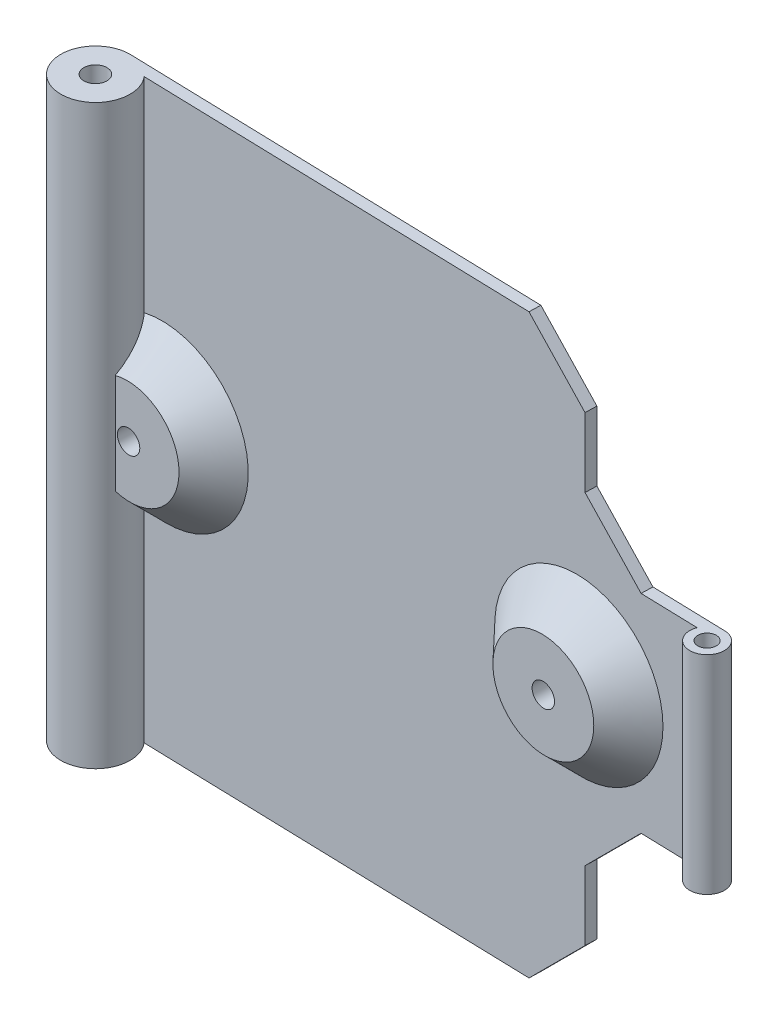
ISO-10303-21;
HEADER;
FILE_DESCRIPTION(('STEP AP214'),'2;1');
FILE_NAME('part.step','',(''),(''),'','','');
FILE_SCHEMA(('AUTOMOTIVE_DESIGN { 1 0 10303 214 1 1 1 1 }'));
ENDSEC;
DATA;
#1=APPLICATION_CONTEXT('core data for automotive mechanical design processes');
#2=APPLICATION_PROTOCOL_DEFINITION('international standard','automotive_design',2000,#1);
#3=PRODUCT_CONTEXT('',#1,'mechanical');
#4=PRODUCT('Part','Part','',(#3));
#5=PRODUCT_RELATED_PRODUCT_CATEGORY('part','',(#4));
#6=PRODUCT_DEFINITION_FORMATION('','',#4);
#7=PRODUCT_DEFINITION_CONTEXT('part definition',#1,'design');
#8=PRODUCT_DEFINITION('design','',#6,#7);
#9=PRODUCT_DEFINITION_SHAPE('','',#8);
#10=(LENGTH_UNIT() NAMED_UNIT(*) SI_UNIT(.MILLI.,.METRE.));
#11=(NAMED_UNIT(*) PLANE_ANGLE_UNIT() SI_UNIT($,.RADIAN.));
#12=(NAMED_UNIT(*) SI_UNIT($,.STERADIAN.) SOLID_ANGLE_UNIT());
#13=UNCERTAINTY_MEASURE_WITH_UNIT(LENGTH_MEASURE(1.E-05),#10,'distance_accuracy_value','');
#14=(GEOMETRIC_REPRESENTATION_CONTEXT(3) GLOBAL_UNCERTAINTY_ASSIGNED_CONTEXT((#13)) GLOBAL_UNIT_ASSIGNED_CONTEXT((#10,
#11,#12)) REPRESENTATION_CONTEXT('',''));
#15=CARTESIAN_POINT('',(0.,0.,0.));
#16=DIRECTION('',(0.,0.,1.));
#17=DIRECTION('',(1.,0.,0.));
#18=AXIS2_PLACEMENT_3D('',#15,#16,#17);
#19=CARTESIAN_POINT('',(0.,50.,0.));
#20=DIRECTION('',(0.,-1.,0.));
#21=DIRECTION('',(0.,0.,-1.));
#22=AXIS2_PLACEMENT_3D('',#19,#20,#21);
#23=CYLINDRICAL_SURFACE('',#22,3.);
#24=DIRECTION('',(0.,-1.,0.));
#25=VECTOR('',#24,1.);
#26=CARTESIAN_POINT('',(2.79854584054607,50.,1.08080580048513));
#27=LINE('',#26,#25);
#28=CARTESIAN_POINT('',(2.79854584054607,20.6599798756648,1.08080580048513));
#29=VERTEX_POINT('',#28);
#30=CARTESIAN_POINT('',(2.79854584054607,29.3400201243352,1.08080580048513));
#31=VERTEX_POINT('',#30);
#32=EDGE_CURVE('E348',#29,#31,#27,.F.);
#33=ORIENTED_EDGE('',*,*,#32,.T.);
#34=CARTESIAN_POINT('',(2.79854584054607,29.3400201243352,1.08080580048513));
#35=CARTESIAN_POINT('',(2.82007181556673,29.4038706555825,1.02507424776286));
#36=CARTESIAN_POINT('',(2.8399761817794,29.4675845790052,0.968575239705698));
#37=CARTESIAN_POINT('',(2.87643303358652,29.5947778702401,0.854242821975873));
#38=CARTESIAN_POINT('',(2.89298539600173,29.6582572293485,0.796409363351863));
#39=CARTESIAN_POINT('',(2.93747112584455,29.8484878894089,0.621128224666331));
#40=CARTESIAN_POINT('',(2.96020106705518,29.9749377254045,0.501982560333769));
#41=CARTESIAN_POINT('',(2.99134260067439,30.2285216011737,0.25902420120585));
#42=CARTESIAN_POINT('',(2.99954860481117,30.3556403062043,0.135169460590613));
#43=CARTESIAN_POINT('',(3.00041504357983,30.6081328848685,-0.11428358913681));
#44=CARTESIAN_POINT('',(2.99308387746865,30.7335076643719,-0.239880919755009));
#45=CARTESIAN_POINT('',(2.96667948756486,30.9451972255342,-0.454815081257195));
#46=CARTESIAN_POINT('',(2.95167556021644,31.0321943591878,-0.543994996693914));
#47=CARTESIAN_POINT('',(2.91317340487217,31.2043631612368,-0.72231721504778));
#48=CARTESIAN_POINT('',(2.88967485735788,31.2895347608384,-0.811459516423813));
#49=CARTESIAN_POINT('',(2.83391270785328,31.4568449511053,-0.988692077252468));
#50=CARTESIAN_POINT('',(2.80170865837741,31.5389999919772,-1.07678538731247));
#51=CARTESIAN_POINT('',(2.72791443263202,31.7000017206489,-1.25200581681771));
#52=CARTESIAN_POINT('',(2.68632848624823,31.7788498804362,-1.33913335317285));
#53=CARTESIAN_POINT('',(2.59279750055973,31.9325778843857,-1.51232750847691));
#54=CARTESIAN_POINT('',(2.54080082536826,32.0074354939697,-1.59838647288653));
#55=CARTESIAN_POINT('',(2.45441598591394,32.115358089772,-1.7258300971988));
#56=CARTESIAN_POINT('',(2.42414959647406,32.150675196394,-1.76812508035364));
#57=CARTESIAN_POINT('',(2.36069278869621,32.2195640709153,-1.8519969266205));
#58=CARTESIAN_POINT('',(2.32750039162025,32.2531346329203,-1.89357328067149));
#59=CARTESIAN_POINT('',(2.29279311550632,32.2856942201146,-1.9347092105758));
#60=B_SPLINE_CURVE_WITH_KNOTS('',3,(#34,#35,#36,#37,#38,#39,#40,#41,#42,#43,#44,#45,#46,#47,#48,
#49,#50,#51,#52,#53,#54,#55,#56,#57,#58,#59),.UNSPECIFIED.,.F.,.F.,(4,2,2,2,2,2,2,2,2,2,2,2,4),
(0.,0.262290216978251,0.524590070833323,1.0495765541585,1.58193658877547,2.11400890767251,
2.49020061634735,2.86640647664902,3.24010121324923,3.61362780280243,3.98905509820947,
4.17756980841248,4.36621299592133),.UNSPECIFIED.);
#61=CARTESIAN_POINT('',(2.29279311550632,32.2856942201146,-1.9347092105758));
#62=VERTEX_POINT('',#61);
#63=EDGE_CURVE('E240',#31,#62,#60,.T.);
#64=ORIENTED_EDGE('',*,*,#63,.T.);
#65=DIRECTION('',(0.,-1.,0.));
#66=VECTOR('',#65,1.);
#67=CARTESIAN_POINT('',(2.29279311550632,50.,-1.9347092105758));
#68=LINE('',#67,#66);
#69=CARTESIAN_POINT('',(2.29279311550632,50.,-1.9347092105758));
#70=VERTEX_POINT('',#69);
#71=EDGE_CURVE('E193',#62,#70,#68,.F.);
#72=ORIENTED_EDGE('',*,*,#71,.T.);
#73=CARTESIAN_POINT('',(0.,50.,0.));
#74=DIRECTION('',(0.,1.,0.));
#75=DIRECTION('',(0.,0.,1.));
#76=AXIS2_PLACEMENT_3D('',#73,#74,#75);
#77=CIRCLE('',#76,3.);
#78=CARTESIAN_POINT('',(0.,50.,-3.));
#79=VERTEX_POINT('',#78);
#80=EDGE_CURVE('E194',#79,#70,#77,.T.);
#81=ORIENTED_EDGE('',*,*,#80,.F.);
#82=CARTESIAN_POINT('',(0.169675411293899,50.,-2.9951978657181));
#83=DIRECTION('',(-0.999599742039958,0.,-0.0282905587369799));
#84=VECTOR('',#83,1.);
#85=LINE('',#82,#84);
#86=CARTESIAN_POINT('',(0.169675411293899,50.,-2.9951978657181));
#87=VERTEX_POINT('',#86);
#88=EDGE_CURVE('E364',#87,#79,#85,.T.);
#89=ORIENTED_EDGE('',*,*,#88,.F.);
#90=DIRECTION('',(0.,-1.,0.));
#91=VECTOR('',#90,1.);
#92=CARTESIAN_POINT('',(0.169675411293889,50.,-2.9951978657181));
#93=LINE('',#92,#91);
#94=CARTESIAN_POINT('',(0.169675411293899,0.,-2.9951978657181));
#95=VERTEX_POINT('',#94);
#96=EDGE_CURVE('E189',#95,#87,#93,.F.);
#97=ORIENTED_EDGE('',*,*,#96,.F.);
#98=CARTESIAN_POINT('',(0.,0.,0.));
#99=DIRECTION('',(0.,1.,0.));
#100=DIRECTION('',(0.0565584704312995,0.,-0.998399288572699));
#101=AXIS2_PLACEMENT_3D('',#98,#99,#100);
#102=CIRCLE('',#101,3.);
#103=CARTESIAN_POINT('',(0.,0.,-3.));
#104=VERTEX_POINT('',#103);
#105=EDGE_CURVE('E204',#95,#104,#102,.T.);
#106=ORIENTED_EDGE('',*,*,#105,.T.);
#107=CARTESIAN_POINT('',(0.,0.,0.));
#108=DIRECTION('',(0.,1.,0.));
#109=DIRECTION('',(0.,0.,1.));
#110=AXIS2_PLACEMENT_3D('',#107,#108,#109);
#111=CIRCLE('',#110,3.);
#112=CARTESIAN_POINT('',(2.29279311550632,0.,-1.9347092105758));
#113=VERTEX_POINT('',#112);
#114=EDGE_CURVE('E195',#104,#113,#111,.T.);
#115=ORIENTED_EDGE('',*,*,#114,.T.);
#116=CARTESIAN_POINT('',(2.29279311550632,17.7143057798854,-1.9347092105758));
#117=VERTEX_POINT('',#116);
#118=EDGE_CURVE('E355',#113,#117,#68,.F.);
#119=ORIENTED_EDGE('',*,*,#118,.T.);
#120=CARTESIAN_POINT('',(2.29279311550632,17.7143057798854,-1.9347092105758));
#121=CARTESIAN_POINT('',(2.32842790920916,17.7477360768004,-1.8924735637738));
#122=CARTESIAN_POINT('',(2.36246569215391,17.7822312239391,-1.84977427803412));
#123=CARTESIAN_POINT('',(2.42746297621913,17.8530619119405,-1.76361517632528));
#124=CARTESIAN_POINT('',(2.45842414298032,17.889396440724,-1.72015578702025));
#125=CARTESIAN_POINT('',(2.54675334396302,18.0005703772862,-1.58906719200969));
#126=CARTESIAN_POINT('',(2.59976862982139,18.0777738045262,-1.50048515947078));
#127=CARTESIAN_POINT('',(2.69468482721303,18.236176026866,-1.32241461095895));
#128=CARTESIAN_POINT('',(2.73666430579859,18.3173414140789,-1.23293748765176));
#129=CARTESIAN_POINT('',(2.81082061030305,18.4831012744542,-1.05297832590611));
#130=CARTESIAN_POINT('',(2.84298882208027,18.5676986874821,-0.962495476270848));
#131=CARTESIAN_POINT('',(2.90461088006892,18.759733022017,-0.759597308911667));
#132=CARTESIAN_POINT('',(2.93161568514737,18.8678322307349,-0.64706502117335));
#133=CARTESIAN_POINT('',(2.97235086477948,19.0866480760395,-0.422130461605912));
#134=CARTESIAN_POINT('',(2.98607737412581,19.1973654651555,-0.309728237141667));
#135=CARTESIAN_POINT('',(3.00089324395222,19.4209205448319,-0.0854716253301811));
#136=CARTESIAN_POINT('',(3.00194028377625,19.5337640776807,0.0263796824627578));
#137=CARTESIAN_POINT('',(2.99176997958652,19.7605790292659,0.248278805975062));
#138=CARTESIAN_POINT('',(2.98055638094671,19.8745500930281,0.358327162038555));
#139=CARTESIAN_POINT('',(2.94673587349155,20.1003816236625,0.57291658051203));
#140=CARTESIAN_POINT('',(2.92442850837558,20.2122212658097,0.677526502546413));
#141=CARTESIAN_POINT('',(2.88298514302981,20.3801374499799,0.831383012170419));
#142=CARTESIAN_POINT('',(2.8678955994467,20.4359732001942,0.882016085768542));
#143=CARTESIAN_POINT('',(2.83513653135902,20.5478305371572,0.98223296315044));
#144=CARTESIAN_POINT('',(2.81746697737747,20.6038521260219,1.03181675493861));
#145=CARTESIAN_POINT('',(2.79854584054607,20.6599798756648,1.08080580048513));
#146=B_SPLINE_CURVE_WITH_KNOTS('',3,(#120,#121,#122,#123,#124,#125,#126,#127,#128,#129,#130,
#131,#132,#133,#134,#135,#136,#137,#138,#139,#140,#141,#142,#143,#144,#145),.UNSPECIFIED.,.F.,
.F.,(4,2,2,2,2,2,2,2,2,2,2,2,4),(0.,0.193682184216476,0.38725893346152,0.773308390959119,
1.15653007992349,1.54008726946575,2.01452359853063,2.48909799075374,2.96525594965125,
3.44126849267271,3.90507419288941,4.13564125600383,4.36621095358612),.UNSPECIFIED.);
#147=EDGE_CURVE('E234',#117,#29,#146,.T.);
#148=ORIENTED_EDGE('',*,*,#147,.T.);
#149=EDGE_LOOP('',(#33,#64,#72,#81,#89,#97,#106,#115,#119,#148));
#150=FACE_BOUND('',#149,.T.);
#151=ADVANCED_FACE('F33',(#150),#23,.T.);
#152=CARTESIAN_POINT('',(-0.0282905587369799,0.,-2.00040025796004));
#153=DIRECTION('',(-0.0282905587369799,0.,0.999599742039957));
#154=DIRECTION('',(0.999599742039958,0.,0.0282905587369799));
#155=AXIS2_PLACEMENT_3D('',#152,#153,#154);
#156=PLANE('',#155);
#157=DIRECTION('',(0.999599742039958,0.,0.0282905587369799));
#158=VECTOR('',#157,1.);
#159=CARTESIAN_POINT('',(-0.0282905587369799,0.,-2.00040025796004));
#160=LINE('',#159,#158);
#161=CARTESIAN_POINT('',(36.6062726107686,0.,-0.963572998445738));
#162=VERTEX_POINT('',#161);
#163=EDGE_CURVE('E179',#113,#162,#160,.T.);
#164=ORIENTED_EDGE('',*,*,#163,.T.);
#165=DIRECTION('',(-0.706823756068776,-0.707106781186549,-0.0200044459264747));
#166=VECTOR('',#165,1.);
#167=CARTESIAN_POINT('',(18.2889910260159,-18.3246161582348,-1.48198662820289));
#168=LINE('',#167,#166);
#169=CARTESIAN_POINT('',(41.6042713209683,5.00000000000001,-0.822120204760839));
#170=VERTEX_POINT('',#169);
#171=EDGE_CURVE('E308',#162,#170,#168,.F.);
#172=ORIENTED_EDGE('',*,*,#171,.T.);
#173=DIRECTION('',(0.,-1.,0.));
#174=VECTOR('',#173,1.);
#175=CARTESIAN_POINT('',(41.6042713209683,0.,-0.822120204760839));
#176=LINE('',#175,#174);
#177=CARTESIAN_POINT('',(41.6042713209683,11.,-0.822120204760839));
#178=VERTEX_POINT('',#177);
#179=EDGE_CURVE('E163',#178,#170,#176,.T.);
#180=ORIENTED_EDGE('',*,*,#179,.F.);
#181=DIRECTION('',(-0.706823756068774,-0.707106781186551,-0.0200044459264747));
#182=VECTOR('',#181,1.);
#183=CARTESIAN_POINT('',(41.6042713209683,11.,-0.822120204760838));
#184=LINE('',#183,#182);
#185=CARTESIAN_POINT('',(46.6022700311681,16.,-0.68066741107594));
#186=VERTEX_POINT('',#185);
#187=EDGE_CURVE('E162',#178,#186,#184,.F.);
#188=ORIENTED_EDGE('',*,*,#187,.T.);
#189=DIRECTION('',(-0.999599742039958,0.,-0.0282905587369799));
#190=VECTOR('',#189,1.);
#191=CARTESIAN_POINT('',(-0.0282905587369799,16.,-2.00040025796004));
#192=LINE('',#191,#190);
#193=CARTESIAN_POINT('',(51.6002687413679,16.,-0.539214617391044));
#194=VERTEX_POINT('',#193);
#195=EDGE_CURVE('E144',#194,#186,#192,.T.);
#196=ORIENTED_EDGE('',*,*,#195,.F.);
#197=DIRECTION('',(0.,-1.,0.));
#198=VECTOR('',#197,1.);
#199=CARTESIAN_POINT('',(51.6002687413679,50.,-0.539214617391041));
#200=LINE('',#199,#198);
#201=CARTESIAN_POINT('',(51.6002687413679,34.,-0.539214617391041));
#202=VERTEX_POINT('',#201);
#203=EDGE_CURVE('E159',#194,#202,#200,.F.);
#204=ORIENTED_EDGE('',*,*,#203,.T.);
#205=DIRECTION('',(0.999599742039958,0.,0.0282905587369799));
#206=VECTOR('',#205,1.);
#207=CARTESIAN_POINT('',(-0.0282905587369799,34.,-2.00040025796004));
#208=LINE('',#207,#206);
#209=CARTESIAN_POINT('',(46.6022700311682,34.,-0.680667411075938));
#210=VERTEX_POINT('',#209);
#211=EDGE_CURVE('E288',#210,#202,#208,.T.);
#212=ORIENTED_EDGE('',*,*,#211,.F.);
#213=DIRECTION('',(0.706823756068783,-0.707106781186542,0.0200044459264749));
#214=VECTOR('',#213,1.);
#215=CARTESIAN_POINT('',(46.6022700311682,34.,-0.680667411075938));
#216=LINE('',#215,#214);
#217=CARTESIAN_POINT('',(41.6042713209683,39.,-0.822120204760839));
#218=VERTEX_POINT('',#217);
#219=EDGE_CURVE('E41',#210,#218,#216,.F.);
#220=ORIENTED_EDGE('',*,*,#219,.T.);
#221=DIRECTION('',(0.,-1.,0.));
#222=VECTOR('',#221,1.);
#223=CARTESIAN_POINT('',(41.6042713209683,0.,-0.822120204760839));
#224=LINE('',#223,#222);
#225=CARTESIAN_POINT('',(41.6042713209683,45.,-0.822120204760839));
#226=VERTEX_POINT('',#225);
#227=EDGE_CURVE('E287',#226,#218,#224,.T.);
#228=ORIENTED_EDGE('',*,*,#227,.F.);
#229=DIRECTION('',(-0.70682375606878,0.707106781186546,-0.0200044459264748));
#230=VECTOR('',#229,1.);
#231=CARTESIAN_POINT('',(43.2789845770146,43.324616158235,-0.774722659778397));
#232=LINE('',#231,#230);
#233=CARTESIAN_POINT('',(36.6062726107685,50.,-0.963572998445738));
#234=VERTEX_POINT('',#233);
#235=EDGE_CURVE('E312',#226,#234,#232,.T.);
#236=ORIENTED_EDGE('',*,*,#235,.T.);
#237=DIRECTION('',(0.999599742039958,0.,0.0282905587369799));
#238=VECTOR('',#237,1.);
#239=CARTESIAN_POINT('',(-0.0282905587369799,50.,-2.00040025796004));
#240=LINE('',#239,#238);
#241=EDGE_CURVE('E168',#70,#234,#240,.T.);
#242=ORIENTED_EDGE('',*,*,#241,.F.);
#243=ORIENTED_EDGE('',*,*,#71,.F.);
#244=CARTESIAN_POINT('',(4.07215358378389,25.,-1.88434995203964));
#245=DIRECTION('',(-0.0282905587369799,0.,0.999599742039957));
#246=DIRECTION('',(0.999599742039958,0.,0.0282905587369799));
#247=AXIS2_PLACEMENT_3D('',#244,#245,#246);
#248=CIRCLE('',#247,7.50000000000004);
#249=EDGE_CURVE('E352',#62,#117,#248,.F.);
#250=ORIENTED_EDGE('',*,*,#249,.T.);
#251=ORIENTED_EDGE('',*,*,#118,.F.);
#252=EDGE_LOOP('',(#164,#172,#180,#188,#196,#204,#212,#220,#228,#236,#242,#243,#250,#251));
#253=FACE_BOUND('',#252,.T.);
#254=CARTESIAN_POINT('',(41.0573440392623,25.,-0.837599278771386));
#255=DIRECTION('',(-0.0282905587369799,0.,0.999599742039957));
#256=DIRECTION('',(0.999599742039958,0.,0.0282905587369799));
#257=AXIS2_PLACEMENT_3D('',#254,#255,#256);
#258=CIRCLE('',#257,7.50000000000004);
#259=CARTESIAN_POINT('',(48.554342104562,25.,-0.625420088244036));
#260=VERTEX_POINT('',#259);
#261=EDGE_CURVE('E241',#260,#260,#258,.F.);
#262=ORIENTED_EDGE('',*,*,#261,.T.);
#263=EDGE_LOOP('',(#262));
#264=FACE_BOUND('',#263,.T.);
#265=ADVANCED_FACE('F156',(#253,#264),#156,.T.);
#266=CARTESIAN_POINT('',(0.,50.,0.));
#267=DIRECTION('',(0.,1.,0.));
#268=DIRECTION('',(0.,0.,1.));
#269=AXIS2_PLACEMENT_3D('',#266,#267,#268);
#270=PLANE('',#269);
#271=ORIENTED_EDGE('',*,*,#241,.T.);
#272=DIRECTION('',(0.0282905587369799,0.,-0.999599742039958));
#273=VECTOR('',#272,1.);
#274=CARTESIAN_POINT('',(36.6345631695055,50.,-1.9631727404857));
#275=LINE('',#274,#273);
#276=CARTESIAN_POINT('',(36.6345631695055,50.,-1.9631727404857));
#277=VERTEX_POINT('',#276);
#278=EDGE_CURVE('E282',#234,#277,#275,.T.);
#279=ORIENTED_EDGE('',*,*,#278,.T.);
#280=DIRECTION('',(0.999599742039957,0.,0.0282905587369799));
#281=VECTOR('',#280,1.);
#282=CARTESIAN_POINT('',(0.,50.,-3.));
#283=LINE('',#282,#281);
#284=EDGE_CURVE('E172',#87,#277,#283,.T.);
#285=ORIENTED_EDGE('',*,*,#284,.F.);
#286=ORIENTED_EDGE('',*,*,#88,.T.);
#287=ORIENTED_EDGE('',*,*,#80,.T.);
#288=EDGE_LOOP('',(#271,#279,#285,#286,#287));
#289=FACE_BOUND('',#288,.T.);
#290=CARTESIAN_POINT('',(0.,50.,0.));
#291=DIRECTION('',(0.,1.,0.));
#292=DIRECTION('',(0.,0.,1.));
#293=AXIS2_PLACEMENT_3D('',#290,#291,#292);
#294=CIRCLE('',#293,1.);
#295=CARTESIAN_POINT('',(0.,50.,1.));
#296=VERTEX_POINT('',#295);
#297=EDGE_CURVE('E391',#296,#296,#294,.T.);
#298=ORIENTED_EDGE('',*,*,#297,.F.);
#299=EDGE_LOOP('',(#298));
#300=FACE_BOUND('',#299,.T.);
#301=ADVANCED_FACE('F382',(#289,#300),#270,.T.);
#302=CARTESIAN_POINT('',(0.,0.,0.));
#303=DIRECTION('',(0.,1.,0.));
#304=DIRECTION('',(0.,0.,1.));
#305=AXIS2_PLACEMENT_3D('',#302,#303,#304);
#306=PLANE('',#305);
#307=DIRECTION('',(0.999599742039957,0.,0.0282905587369799));
#308=VECTOR('',#307,1.);
#309=CARTESIAN_POINT('',(0.,0.,-3.));
#310=LINE('',#309,#308);
#311=CARTESIAN_POINT('',(36.6345631695055,0.,-1.9631727404857));
#312=VERTEX_POINT('',#311);
#313=EDGE_CURVE('E180',#95,#312,#310,.T.);
#314=ORIENTED_EDGE('',*,*,#313,.T.);
#315=DIRECTION('',(-0.0282905587369799,0.,0.999599742039958));
#316=VECTOR('',#315,1.);
#317=CARTESIAN_POINT('',(36.5497254638586,0.,1.03442619237335));
#318=LINE('',#317,#316);
#319=EDGE_CURVE('E325',#312,#162,#318,.T.);
#320=ORIENTED_EDGE('',*,*,#319,.T.);
#321=ORIENTED_EDGE('',*,*,#163,.F.);
#322=ORIENTED_EDGE('',*,*,#114,.F.);
#323=ORIENTED_EDGE('',*,*,#105,.F.);
#324=EDGE_LOOP('',(#314,#320,#321,#322,#323));
#325=FACE_BOUND('',#324,.T.);
#326=CARTESIAN_POINT('',(0.,0.,0.));
#327=DIRECTION('',(0.,1.,0.));
#328=DIRECTION('',(0.,0.,1.));
#329=AXIS2_PLACEMENT_3D('',#326,#327,#328);
#330=CIRCLE('',#329,1.);
#331=CARTESIAN_POINT('',(0.,0.,1.));
#332=VERTEX_POINT('',#331);
#333=EDGE_CURVE('E184',#332,#332,#330,.T.);
#334=ORIENTED_EDGE('',*,*,#333,.T.);
#335=EDGE_LOOP('',(#334));
#336=FACE_BOUND('',#335,.T.);
#337=ADVANCED_FACE('F219',(#325,#336),#306,.F.);
#338=CARTESIAN_POINT('',(0.,50.,0.));
#339=DIRECTION('',(0.,-1.,0.));
#340=DIRECTION('',(0.,0.,-1.));
#341=AXIS2_PLACEMENT_3D('',#338,#339,#340);
#342=CYLINDRICAL_SURFACE('',#341,1.);
#343=ORIENTED_EDGE('',*,*,#297,.T.);
#344=EDGE_LOOP('',(#343));
#345=FACE_BOUND('',#344,.T.);
#346=ORIENTED_EDGE('',*,*,#333,.F.);
#347=EDGE_LOOP('',(#346));
#348=FACE_BOUND('',#347,.T.);
#349=ADVANCED_FACE('F398',(#345,#348),#342,.F.);
#350=CARTESIAN_POINT('',(0.,0.,-3.));
#351=DIRECTION('',(-0.0282905587369799,0.,0.999599742039958));
#352=DIRECTION('',(0.999599742039958,0.,0.0282905587369799));
#353=AXIS2_PLACEMENT_3D('',#350,#351,#352);
#354=PLANE('',#353);
#355=DIRECTION('',(0.,-1.,0.));
#356=VECTOR('',#355,1.);
#357=CARTESIAN_POINT('',(41.6325618797053,0.,-1.8217199468008));
#358=LINE('',#357,#356);
#359=CARTESIAN_POINT('',(41.6325618797053,11.,-1.8217199468008));
#360=VERTEX_POINT('',#359);
#361=CARTESIAN_POINT('',(41.6325618797053,5.00000000000001,-1.8217199468008));
#362=VERTEX_POINT('',#361);
#363=EDGE_CURVE('E318',#360,#362,#358,.T.);
#364=ORIENTED_EDGE('',*,*,#363,.T.);
#365=DIRECTION('',(0.706823756068776,0.707106781186549,0.0200044459264748));
#366=VECTOR('',#365,1.);
#367=CARTESIAN_POINT('',(36.6345631695055,0.,-1.9631727404857));
#368=LINE('',#367,#366);
#369=EDGE_CURVE('E277',#362,#312,#368,.F.);
#370=ORIENTED_EDGE('',*,*,#369,.T.);
#371=ORIENTED_EDGE('',*,*,#313,.F.);
#372=ORIENTED_EDGE('',*,*,#96,.T.);
#373=ORIENTED_EDGE('',*,*,#284,.T.);
#374=DIRECTION('',(0.70682375606878,-0.707106781186546,0.0200044459264749));
#375=VECTOR('',#374,1.);
#376=CARTESIAN_POINT('',(41.6325618797053,45.,-1.8217199468008));
#377=LINE('',#376,#375);
#378=CARTESIAN_POINT('',(41.6325618797053,45.,-1.8217199468008));
#379=VERTEX_POINT('',#378);
#380=EDGE_CURVE('E310',#277,#379,#377,.T.);
#381=ORIENTED_EDGE('',*,*,#380,.T.);
#382=DIRECTION('',(0.,-1.,0.));
#383=VECTOR('',#382,1.);
#384=CARTESIAN_POINT('',(41.6325618797053,0.,-1.8217199468008));
#385=LINE('',#384,#383);
#386=CARTESIAN_POINT('',(41.6325618797053,39.,-1.8217199468008));
#387=VERTEX_POINT('',#386);
#388=EDGE_CURVE('E333',#379,#387,#385,.T.);
#389=ORIENTED_EDGE('',*,*,#388,.T.);
#390=DIRECTION('',(-0.706823756068783,0.707106781186542,-0.0200044459264749));
#391=VECTOR('',#390,1.);
#392=CARTESIAN_POINT('',(40.3084759096315,40.3246161582351,-1.8591940780293));
#393=LINE('',#392,#391);
#394=CARTESIAN_POINT('',(46.6305605899052,34.,-1.6802671531159));
#395=VERTEX_POINT('',#394);
#396=EDGE_CURVE('E11',#387,#395,#393,.F.);
#397=ORIENTED_EDGE('',*,*,#396,.T.);
#398=DIRECTION('',(0.999599742039958,0.,0.0282905587369799));
#399=VECTOR('',#398,1.);
#400=CARTESIAN_POINT('',(0.,34.,-3.));
#401=LINE('',#400,#399);
#402=CARTESIAN_POINT('',(53.,34.,-1.5));
#403=VERTEX_POINT('',#402);
#404=EDGE_CURVE('E292',#395,#403,#401,.T.);
#405=ORIENTED_EDGE('',*,*,#404,.T.);
#406=DIRECTION('',(0.,1.,0.));
#407=VECTOR('',#406,1.);
#408=CARTESIAN_POINT('',(53.,0.,-1.5));
#409=LINE('',#408,#407);
#410=CARTESIAN_POINT('',(53.,16.,-1.5));
#411=VERTEX_POINT('',#410);
#412=EDGE_CURVE('E182',#411,#403,#409,.T.);
#413=ORIENTED_EDGE('',*,*,#412,.F.);
#414=DIRECTION('',(-0.999599742039958,0.,-0.0282905587369799));
#415=VECTOR('',#414,1.);
#416=CARTESIAN_POINT('',(0.,16.,-3.));
#417=LINE('',#416,#415);
#418=CARTESIAN_POINT('',(46.6305605899051,16.,-1.6802671531159));
#419=VERTEX_POINT('',#418);
#420=EDGE_CURVE('E147',#411,#419,#417,.T.);
#421=ORIENTED_EDGE('',*,*,#420,.T.);
#422=DIRECTION('',(0.706823756068774,0.707106781186551,0.0200044459264747));
#423=VECTOR('',#422,1.);
#424=CARTESIAN_POINT('',(15.3184823586331,-15.3246161582349,-2.56645804645378));
#425=LINE('',#424,#423);
#426=EDGE_CURVE('E285',#419,#360,#425,.F.);
#427=ORIENTED_EDGE('',*,*,#426,.T.);
#428=EDGE_LOOP('',(#364,#370,#371,#372,#373,#381,#389,#397,#405,#413,#421,#427));
#429=FACE_BOUND('',#428,.T.);
#430=ADVANCED_FACE('F301',(#429),#354,.F.);
#431=CARTESIAN_POINT('',(53.,50.,0.));
#432=DIRECTION('',(0.,-1.,0.));
#433=DIRECTION('',(0.,0.,-1.));
#434=AXIS2_PLACEMENT_3D('',#431,#432,#433);
#435=CYLINDRICAL_SURFACE('',#434,1.5);
#436=ORIENTED_EDGE('',*,*,#203,.F.);
#437=CARTESIAN_POINT('',(53.,16.,0.));
#438=DIRECTION('',(0.,1.,0.));
#439=DIRECTION('',(0.,0.,1.));
#440=AXIS2_PLACEMENT_3D('',#437,#438,#439);
#441=CIRCLE('',#440,1.5);
#442=EDGE_CURVE('E140',#194,#411,#441,.T.);
#443=ORIENTED_EDGE('',*,*,#442,.T.);
#444=ORIENTED_EDGE('',*,*,#412,.T.);
#445=CARTESIAN_POINT('',(53.,34.,0.));
#446=DIRECTION('',(0.,-1.,0.));
#447=DIRECTION('',(0.,0.,-1.));
#448=AXIS2_PLACEMENT_3D('',#445,#446,#447);
#449=CIRCLE('',#448,1.5);
#450=EDGE_CURVE('E167',#403,#202,#449,.T.);
#451=ORIENTED_EDGE('',*,*,#450,.T.);
#452=EDGE_LOOP('',(#436,#443,#444,#451));
#453=FACE_BOUND('',#452,.T.);
#454=ADVANCED_FACE('F165',(#453),#435,.T.);
#455=CARTESIAN_POINT('',(53.,50.,0.));
#456=DIRECTION('',(0.,-1.,0.));
#457=DIRECTION('',(0.,0.,-1.));
#458=AXIS2_PLACEMENT_3D('',#455,#456,#457);
#459=CYLINDRICAL_SURFACE('',#458,0.800000000000003);
#460=CARTESIAN_POINT('',(53.,34.,0.));
#461=DIRECTION('',(0.,-1.,0.));
#462=DIRECTION('',(0.,0.,-1.));
#463=AXIS2_PLACEMENT_3D('',#460,#461,#462);
#464=CIRCLE('',#463,0.800000000000003);
#465=CARTESIAN_POINT('',(53.,34.,-0.800000000000003));
#466=VERTEX_POINT('',#465);
#467=EDGE_CURVE('E335',#466,#466,#464,.T.);
#468=ORIENTED_EDGE('',*,*,#467,.F.);
#469=EDGE_LOOP('',(#468));
#470=FACE_BOUND('',#469,.T.);
#471=CARTESIAN_POINT('',(53.,16.,0.));
#472=DIRECTION('',(0.,1.,0.));
#473=DIRECTION('',(0.,0.,1.));
#474=AXIS2_PLACEMENT_3D('',#471,#472,#473);
#475=CIRCLE('',#474,0.800000000000003);
#476=CARTESIAN_POINT('',(53.,16.,0.800000000000003));
#477=VERTEX_POINT('',#476);
#478=EDGE_CURVE('E328',#477,#477,#475,.T.);
#479=ORIENTED_EDGE('',*,*,#478,.F.);
#480=EDGE_LOOP('',(#479));
#481=FACE_BOUND('',#480,.T.);
#482=ADVANCED_FACE('F436',(#470,#481),#459,.F.);
#483=CARTESIAN_POINT('',(3.98728190757295,25.,1.11444927408023));
#484=DIRECTION('',(-0.0282905587369799,0.,0.999599742039957));
#485=DIRECTION('',(0.999599742039957,0.,0.0282905587369799));
#486=AXIS2_PLACEMENT_3D('',#483,#484,#485);
#487=PLANE('',#486);
#488=CARTESIAN_POINT('',(3.98728190757295,25.,1.11444927408023));
#489=DIRECTION('',(-0.0282905587369799,0.,0.999599742039957));
#490=DIRECTION('',(0.999599742039957,0.,0.0282905587369799));
#491=AXIS2_PLACEMENT_3D('',#488,#489,#490);
#492=CIRCLE('',#491,1.);
#493=CARTESIAN_POINT('',(4.98688164961291,25.,1.14273983281721));
#494=VERTEX_POINT('',#493);
#495=EDGE_CURVE('E169',#494,#494,#492,.T.);
#496=ORIENTED_EDGE('',*,*,#495,.F.);
#497=EDGE_LOOP('',(#496));
#498=FACE_BOUND('',#497,.T.);
#499=ORIENTED_EDGE('',*,*,#32,.F.);
#500=CARTESIAN_POINT('',(3.98728190757295,25.,1.11444927408023));
#501=DIRECTION('',(-0.0282905587369799,0.,0.999599742039957));
#502=DIRECTION('',(0.999599742039957,0.,0.0282905587369799));
#503=AXIS2_PLACEMENT_3D('',#500,#501,#502);
#504=CIRCLE('',#503,4.50000000000007);
#505=EDGE_CURVE('E338',#29,#31,#504,.T.);
#506=ORIENTED_EDGE('',*,*,#505,.T.);
#507=EDGE_LOOP('',(#499,#506));
#508=FACE_BOUND('',#507,.T.);
#509=ADVANCED_FACE('F428',(#498,#508),#487,.T.);
#510=CARTESIAN_POINT('',(3.98728190757295,25.,1.11444927408023));
#511=DIRECTION('',(0.0282905587369799,0.,-0.999599742039957));
#512=DIRECTION('',(-0.999599742039958,0.,-0.0282905587369799));
#513=AXIS2_PLACEMENT_3D('',#510,#511,#512);
#514=CYLINDRICAL_SURFACE('',#513,1.);
#515=ORIENTED_EDGE('',*,*,#495,.T.);
#516=EDGE_LOOP('',(#515));
#517=FACE_BOUND('',#516,.T.);
#518=CARTESIAN_POINT('',(4.07215358378389,25.,-1.88434995203964));
#519=DIRECTION('',(-0.0282905587369799,0.,0.999599742039957));
#520=DIRECTION('',(0.999599742039958,0.,0.0282905587369799));
#521=AXIS2_PLACEMENT_3D('',#518,#519,#520);
#522=CIRCLE('',#521,1.);
#523=CARTESIAN_POINT('',(5.07175332582385,25.,-1.85605939330266));
#524=VERTEX_POINT('',#523);
#525=EDGE_CURVE('E360',#524,#524,#522,.F.);
#526=ORIENTED_EDGE('',*,*,#525,.T.);
#527=EDGE_LOOP('',(#526));
#528=FACE_BOUND('',#527,.T.);
#529=ADVANCED_FACE('F421',(#517,#528),#514,.F.);
#530=ORIENTED_EDGE('',*,*,#525,.F.);
#531=EDGE_LOOP('',(#530));
#532=FACE_BOUND('',#531,.T.);
#533=ADVANCED_FACE('F413',(#532),#156,.T.);
#534=CARTESIAN_POINT('',(40.9724723630514,25.,2.16119994734848));
#535=DIRECTION('',(-0.0282905587369799,0.,0.999599742039957));
#536=DIRECTION('',(0.999599742039957,0.,0.0282905587369799));
#537=AXIS2_PLACEMENT_3D('',#534,#535,#536);
#538=PLANE('',#537);
#539=CARTESIAN_POINT('',(40.9724723630514,25.,2.16119994734848));
#540=DIRECTION('',(-0.0282905587369799,0.,0.999599742039957));
#541=DIRECTION('',(0.999599742039957,0.,0.0282905587369799));
#542=AXIS2_PLACEMENT_3D('',#539,#540,#541);
#543=CIRCLE('',#542,4.50000000000007);
#544=CARTESIAN_POINT('',(45.4706712022313,25.,2.2885074616649));
#545=VERTEX_POINT('',#544);
#546=EDGE_CURVE('E340',#545,#545,#543,.T.);
#547=ORIENTED_EDGE('',*,*,#546,.T.);
#548=EDGE_LOOP('',(#547));
#549=FACE_BOUND('',#548,.T.);
#550=CARTESIAN_POINT('',(40.9724723630514,25.,2.16119994734848));
#551=DIRECTION('',(-0.0282905587369799,0.,0.999599742039957));
#552=DIRECTION('',(0.999599742039957,0.,0.0282905587369799));
#553=AXIS2_PLACEMENT_3D('',#550,#551,#552);
#554=CIRCLE('',#553,0.999999999999997);
#555=CARTESIAN_POINT('',(41.9720721050913,25.,2.18949050608546));
#556=VERTEX_POINT('',#555);
#557=EDGE_CURVE('E175',#556,#556,#554,.T.);
#558=ORIENTED_EDGE('',*,*,#557,.F.);
#559=EDGE_LOOP('',(#558));
#560=FACE_BOUND('',#559,.T.);
#561=ADVANCED_FACE('F420',(#549,#560),#538,.T.);
#562=CARTESIAN_POINT('',(40.9724723630514,25.,2.16119994734848));
#563=DIRECTION('',(0.0282905587369799,0.,-0.999599742039957));
#564=DIRECTION('',(-0.999599742039958,0.,-0.0282905587369799));
#565=AXIS2_PLACEMENT_3D('',#562,#563,#564);
#566=CYLINDRICAL_SURFACE('',#565,0.999999999999997);
#567=ORIENTED_EDGE('',*,*,#557,.T.);
#568=EDGE_LOOP('',(#567));
#569=FACE_BOUND('',#568,.T.);
#570=CARTESIAN_POINT('',(41.0573440392623,25.,-0.837599278771386));
#571=DIRECTION('',(-0.0282905587369799,0.,0.999599742039957));
#572=DIRECTION('',(0.999599742039958,0.,0.0282905587369799));
#573=AXIS2_PLACEMENT_3D('',#570,#571,#572);
#574=CIRCLE('',#573,0.999999999999997);
#575=CARTESIAN_POINT('',(42.0569437813023,25.,-0.809308720034406));
#576=VERTEX_POINT('',#575);
#577=EDGE_CURVE('E357',#576,#576,#574,.F.);
#578=ORIENTED_EDGE('',*,*,#577,.T.);
#579=EDGE_LOOP('',(#578));
#580=FACE_BOUND('',#579,.T.);
#581=ADVANCED_FACE('F417',(#569,#580),#566,.F.);
#582=ORIENTED_EDGE('',*,*,#577,.F.);
#583=EDGE_LOOP('',(#582));
#584=FACE_BOUND('',#583,.T.);
#585=ADVANCED_FACE('F407',(#584),#156,.T.);
#586=CARTESIAN_POINT('',(40.9158912455774,25.,4.16039943142849));
#587=DIRECTION('',(0.0282905587369801,0.,-0.999599742039957));
#588=DIRECTION('',(-0.999599742039957,0.,-0.0282905587369801));
#589=AXIS2_PLACEMENT_3D('',#586,#587,#588);
#590=CONICAL_SURFACE('',#589,2.5,0.785398163397444);
#591=ORIENTED_EDGE('',*,*,#261,.F.);
#592=EDGE_LOOP('',(#591));
#593=FACE_BOUND('',#592,.T.);
#594=ORIENTED_EDGE('',*,*,#546,.F.);
#595=EDGE_LOOP('',(#594));
#596=FACE_BOUND('',#595,.T.);
#597=ADVANCED_FACE('F222',(#593,#596),#590,.T.);
#598=CARTESIAN_POINT('',(3.93070079009898,25.,3.11364875816023));
#599=DIRECTION('',(0.0282905587369799,0.,-0.999599742039957));
#600=DIRECTION('',(-0.999599742039957,0.,-0.0282905587369799));
#601=AXIS2_PLACEMENT_3D('',#598,#599,#600);
#602=CONICAL_SURFACE('',#601,2.5,0.785398163397443);
#603=ORIENTED_EDGE('',*,*,#147,.F.);
#604=ORIENTED_EDGE('',*,*,#249,.F.);
#605=ORIENTED_EDGE('',*,*,#63,.F.);
#606=ORIENTED_EDGE('',*,*,#505,.F.);
#607=EDGE_LOOP('',(#603,#604,#605,#606));
#608=FACE_BOUND('',#607,.T.);
#609=ADVANCED_FACE('F247',(#608),#602,.T.);
#610=CARTESIAN_POINT('',(41.6764278640395,50.,-3.37165139327519));
#611=DIRECTION('',(-0.999599742039957,0.,-0.0282905587369799));
#612=DIRECTION('',(-0.0282905587369799,0.,0.999599742039957));
#613=AXIS2_PLACEMENT_3D('',#610,#611,#612);
#614=PLANE('',#613);
#615=ORIENTED_EDGE('',*,*,#227,.T.);
#616=DIRECTION('',(0.0282905587369799,0.,-0.999599742039957));
#617=VECTOR('',#616,1.);
#618=CARTESIAN_POINT('',(41.6325618797053,39.,-1.8217199468008));
#619=LINE('',#618,#617);
#620=EDGE_CURVE('E54',#218,#387,#619,.T.);
#621=ORIENTED_EDGE('',*,*,#620,.T.);
#622=ORIENTED_EDGE('',*,*,#388,.F.);
#623=DIRECTION('',(-0.0282905587369799,0.,0.999599742039957));
#624=VECTOR('',#623,1.);
#625=CARTESIAN_POINT('',(41.6042713209683,45.,-0.822120204760839));
#626=LINE('',#625,#624);
#627=EDGE_CURVE('E272',#379,#226,#626,.T.);
#628=ORIENTED_EDGE('',*,*,#627,.T.);
#629=EDGE_LOOP('',(#615,#621,#622,#628));
#630=FACE_BOUND('',#629,.T.);
#631=ADVANCED_FACE('F251',(#630),#614,.F.);
#632=CARTESIAN_POINT('',(41.6764278640395,34.,-3.37165139327519));
#633=DIRECTION('',(0.,-1.,0.));
#634=DIRECTION('',(0.,0.,-1.));
#635=AXIS2_PLACEMENT_3D('',#632,#633,#634);
#636=PLANE('',#635);
#637=ORIENTED_EDGE('',*,*,#404,.F.);
#638=DIRECTION('',(-0.0282905587369799,0.,0.999599742039958));
#639=VECTOR('',#638,1.);
#640=CARTESIAN_POINT('',(46.6022700311682,34.,-0.680667411075939));
#641=LINE('',#640,#639);
#642=EDGE_CURVE('E270',#395,#210,#641,.T.);
#643=ORIENTED_EDGE('',*,*,#642,.T.);
#644=ORIENTED_EDGE('',*,*,#211,.T.);
#645=ORIENTED_EDGE('',*,*,#450,.F.);
#646=EDGE_LOOP('',(#637,#643,#644,#645));
#647=FACE_BOUND('',#646,.T.);
#648=ORIENTED_EDGE('',*,*,#467,.T.);
#649=EDGE_LOOP('',(#648));
#650=FACE_BOUND('',#649,.T.);
#651=ADVANCED_FACE('F496',(#647,#650),#636,.F.);
#652=CARTESIAN_POINT('',(41.6764278640395,0.,-3.37165139327519));
#653=DIRECTION('',(-0.999599742039957,0.,-0.0282905587369799));
#654=DIRECTION('',(-0.0282905587369799,0.,0.999599742039957));
#655=AXIS2_PLACEMENT_3D('',#652,#653,#654);
#656=PLANE('',#655);
#657=ORIENTED_EDGE('',*,*,#179,.T.);
#658=DIRECTION('',(0.0282905587369799,0.,-0.999599742039957));
#659=VECTOR('',#658,1.);
#660=CARTESIAN_POINT('',(41.6764278640395,5.00000000000001,-3.37165139327519));
#661=LINE('',#660,#659);
#662=EDGE_CURVE('E307',#170,#362,#661,.T.);
#663=ORIENTED_EDGE('',*,*,#662,.T.);
#664=ORIENTED_EDGE('',*,*,#363,.F.);
#665=DIRECTION('',(-0.0282905587369799,0.,0.999599742039957));
#666=VECTOR('',#665,1.);
#667=CARTESIAN_POINT('',(41.6042713209683,11.,-0.82212020476084));
#668=LINE('',#667,#666);
#669=EDGE_CURVE('E305',#360,#178,#668,.T.);
#670=ORIENTED_EDGE('',*,*,#669,.T.);
#671=EDGE_LOOP('',(#657,#663,#664,#670));
#672=FACE_BOUND('',#671,.T.);
#673=ADVANCED_FACE('F502',(#672),#656,.F.);
#674=CARTESIAN_POINT('',(41.6764278640395,16.,-3.37165139327519));
#675=DIRECTION('',(0.,1.,0.));
#676=DIRECTION('',(0.,0.,1.));
#677=AXIS2_PLACEMENT_3D('',#674,#675,#676);
#678=PLANE('',#677);
#679=ORIENTED_EDGE('',*,*,#195,.T.);
#680=DIRECTION('',(0.0282905587369799,0.,-0.999599742039958));
#681=VECTOR('',#680,1.);
#682=CARTESIAN_POINT('',(46.6305605899051,16.,-1.6802671531159));
#683=LINE('',#682,#681);
#684=EDGE_CURVE('E273',#186,#419,#683,.T.);
#685=ORIENTED_EDGE('',*,*,#684,.T.);
#686=ORIENTED_EDGE('',*,*,#420,.F.);
#687=ORIENTED_EDGE('',*,*,#442,.F.);
#688=EDGE_LOOP('',(#679,#685,#686,#687));
#689=FACE_BOUND('',#688,.T.);
#690=ORIENTED_EDGE('',*,*,#478,.T.);
#691=EDGE_LOOP('',(#690));
#692=FACE_BOUND('',#691,.T.);
#693=ADVANCED_FACE('F142',(#689,#692),#678,.F.);
#694=CARTESIAN_POINT('',(36.5497254638586,0.,1.03442619237335));
#695=DIRECTION('',(-0.706823756068779,0.707106781186546,-0.0200044459264748));
#696=DIRECTION('',(-0.0282905587369799,0.,0.999599742039957));
#697=AXIS2_PLACEMENT_3D('',#694,#695,#696);
#698=PLANE('',#697);
#699=ORIENTED_EDGE('',*,*,#369,.F.);
#700=ORIENTED_EDGE('',*,*,#662,.F.);
#701=ORIENTED_EDGE('',*,*,#171,.F.);
#702=ORIENTED_EDGE('',*,*,#319,.F.);
#703=EDGE_LOOP('',(#699,#700,#701,#702));
#704=FACE_BOUND('',#703,.T.);
#705=ADVANCED_FACE('F253',(#704),#698,.F.);
#706=CARTESIAN_POINT('',(41.6764278640395,11.,-3.37165139327519));
#707=DIRECTION('',(0.706823756068781,-0.707106781186544,0.0200044459264749));
#708=DIRECTION('',(0.0282905587369799,0.,-0.999599742039957));
#709=AXIS2_PLACEMENT_3D('',#706,#707,#708);
#710=PLANE('',#709);
#711=ORIENTED_EDGE('',*,*,#426,.F.);
#712=ORIENTED_EDGE('',*,*,#684,.F.);
#713=ORIENTED_EDGE('',*,*,#187,.F.);
#714=ORIENTED_EDGE('',*,*,#669,.F.);
#715=EDGE_LOOP('',(#711,#712,#713,#714));
#716=FACE_BOUND('',#715,.T.);
#717=ADVANCED_FACE('F257',(#716),#710,.T.);
#718=CARTESIAN_POINT('',(46.6744265742393,34.,-3.23019859959029));
#719=DIRECTION('',(0.706823756068772,0.707106781186553,0.0200044459264746));
#720=DIRECTION('',(0.0282905587369799,0.,-0.999599742039957));
#721=AXIS2_PLACEMENT_3D('',#718,#719,#720);
#722=PLANE('',#721);
#723=ORIENTED_EDGE('',*,*,#396,.F.);
#724=ORIENTED_EDGE('',*,*,#620,.F.);
#725=ORIENTED_EDGE('',*,*,#219,.F.);
#726=ORIENTED_EDGE('',*,*,#642,.F.);
#727=EDGE_LOOP('',(#723,#724,#725,#726));
#728=FACE_BOUND('',#727,.T.);
#729=ADVANCED_FACE('F260',(#728),#722,.T.);
#730=CARTESIAN_POINT('',(41.6764278640395,45.,-3.37165139327519));
#731=DIRECTION('',(0.706823756068776,0.70710678118655,0.0200044459264747));
#732=DIRECTION('',(0.0282905587369799,0.,-0.999599742039957));
#733=AXIS2_PLACEMENT_3D('',#730,#731,#732);
#734=PLANE('',#733);
#735=ORIENTED_EDGE('',*,*,#380,.F.);
#736=ORIENTED_EDGE('',*,*,#278,.F.);
#737=ORIENTED_EDGE('',*,*,#235,.F.);
#738=ORIENTED_EDGE('',*,*,#627,.F.);
#739=EDGE_LOOP('',(#735,#736,#737,#738));
#740=FACE_BOUND('',#739,.T.);
#741=ADVANCED_FACE('F35',(#740),#734,.T.);
#742=CLOSED_SHELL('',(#151,#265,#301,#337,#349,#430,#454,#482,#509,#529,#533,#561,#581,#585,
#597,#609,#631,#651,#673,#693,#705,#717,#729,#741));
#743=MANIFOLD_SOLID_BREP('B2',#742);
#744=ADVANCED_BREP_SHAPE_REPRESENTATION('',(#18,#743),#14);
#745=SHAPE_DEFINITION_REPRESENTATION(#9,#744);
ENDSEC;
END-ISO-10303-21;
